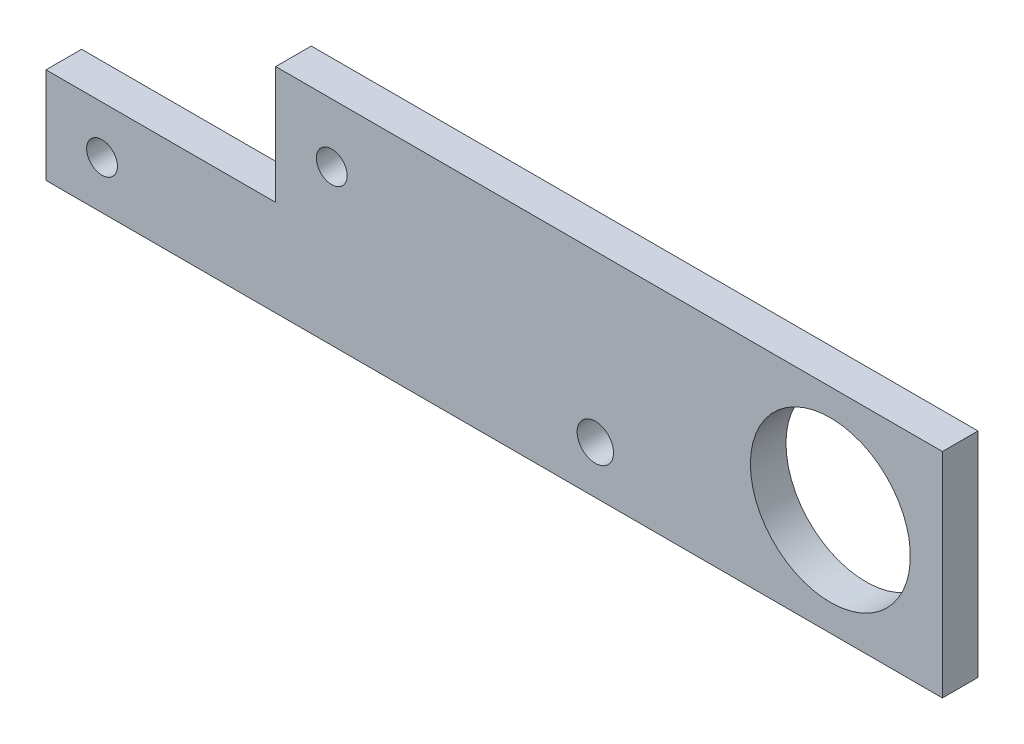
ISO-10303-21;
HEADER;
FILE_DESCRIPTION(('STEP AP214'),'2;1');
FILE_NAME('part.step','',(''),(''),'','','');
FILE_SCHEMA(('AUTOMOTIVE_DESIGN { 1 0 10303 214 1 1 1 1 }'));
ENDSEC;
DATA;
#1=APPLICATION_CONTEXT('core data for automotive mechanical design processes');
#2=APPLICATION_PROTOCOL_DEFINITION('international standard','automotive_design',2000,#1);
#3=PRODUCT_CONTEXT('',#1,'mechanical');
#4=PRODUCT('Part','Part','',(#3));
#5=PRODUCT_RELATED_PRODUCT_CATEGORY('part','',(#4));
#6=PRODUCT_DEFINITION_FORMATION('','',#4);
#7=PRODUCT_DEFINITION_CONTEXT('part definition',#1,'design');
#8=PRODUCT_DEFINITION('design','',#6,#7);
#9=PRODUCT_DEFINITION_SHAPE('','',#8);
#10=(LENGTH_UNIT() NAMED_UNIT(*) SI_UNIT(.MILLI.,.METRE.));
#11=(NAMED_UNIT(*) PLANE_ANGLE_UNIT() SI_UNIT($,.RADIAN.));
#12=(NAMED_UNIT(*) SI_UNIT($,.STERADIAN.) SOLID_ANGLE_UNIT());
#13=UNCERTAINTY_MEASURE_WITH_UNIT(LENGTH_MEASURE(1.E-05),#10,'distance_accuracy_value','');
#14=(GEOMETRIC_REPRESENTATION_CONTEXT(3) GLOBAL_UNCERTAINTY_ASSIGNED_CONTEXT((#13)) GLOBAL_UNIT_ASSIGNED_CONTEXT((#10,
#11,#12)) REPRESENTATION_CONTEXT('',''));
#15=CARTESIAN_POINT('',(0.,0.,0.));
#16=DIRECTION('',(0.,0.,1.));
#17=DIRECTION('',(1.,0.,0.));
#18=AXIS2_PLACEMENT_3D('',#15,#16,#17);
#19=CARTESIAN_POINT('',(0.,0.,6.35));
#20=DIRECTION('',(1.,0.,0.));
#21=DIRECTION('',(0.,1.,0.));
#22=AXIS2_PLACEMENT_3D('',#19,#20,#21);
#23=PLANE('',#22);
#24=DIRECTION('',(0.,0.,1.));
#25=VECTOR('',#24,1.);
#26=CARTESIAN_POINT('',(0.,-21.,0.));
#27=LINE('',#26,#25);
#28=CARTESIAN_POINT('',(0.,-21.,0.));
#29=VERTEX_POINT('',#28);
#30=CARTESIAN_POINT('',(0.,-21.,6.35));
#31=VERTEX_POINT('',#30);
#32=EDGE_CURVE('E104',#29,#31,#27,.T.);
#33=ORIENTED_EDGE('',*,*,#32,.F.);
#34=DIRECTION('',(0.,-1.,0.));
#35=VECTOR('',#34,1.);
#36=CARTESIAN_POINT('',(0.,0.,0.));
#37=LINE('',#36,#35);
#38=CARTESIAN_POINT('',(0.,-38.1,0.));
#39=VERTEX_POINT('',#38);
#40=EDGE_CURVE('E115',#29,#39,#37,.T.);
#41=ORIENTED_EDGE('',*,*,#40,.T.);
#42=DIRECTION('',(0.,0.,-1.));
#43=VECTOR('',#42,1.);
#44=CARTESIAN_POINT('',(0.,-38.1,6.35));
#45=LINE('',#44,#43);
#46=CARTESIAN_POINT('',(0.,-38.1,6.35));
#47=VERTEX_POINT('',#46);
#48=EDGE_CURVE('E11',#47,#39,#45,.T.);
#49=ORIENTED_EDGE('',*,*,#48,.F.);
#50=DIRECTION('',(0.,-1.,0.));
#51=VECTOR('',#50,1.);
#52=CARTESIAN_POINT('',(0.,0.,6.35));
#53=LINE('',#52,#51);
#54=EDGE_CURVE('E81',#31,#47,#53,.T.);
#55=ORIENTED_EDGE('',*,*,#54,.F.);
#56=EDGE_LOOP('',(#33,#41,#49,#55));
#57=FACE_BOUND('',#56,.T.);
#58=ADVANCED_FACE('F39',(#57),#23,.F.);
#59=CARTESIAN_POINT('',(0.,-38.1,6.35));
#60=DIRECTION('',(0.,1.,0.));
#61=DIRECTION('',(0.,0.,1.));
#62=AXIS2_PLACEMENT_3D('',#59,#60,#61);
#63=PLANE('',#62);
#64=DIRECTION('',(1.,0.,0.));
#65=VECTOR('',#64,1.);
#66=CARTESIAN_POINT('',(0.,-38.1,0.));
#67=LINE('',#66,#65);
#68=CARTESIAN_POINT('',(160.,-38.1,0.));
#69=VERTEX_POINT('',#68);
#70=EDGE_CURVE('E116',#39,#69,#67,.T.);
#71=ORIENTED_EDGE('',*,*,#70,.T.);
#72=DIRECTION('',(0.,0.,-1.));
#73=VECTOR('',#72,1.);
#74=CARTESIAN_POINT('',(160.,-38.1,6.35));
#75=LINE('',#74,#73);
#76=CARTESIAN_POINT('',(160.,-38.1,6.35));
#77=VERTEX_POINT('',#76);
#78=EDGE_CURVE('E46',#77,#69,#75,.T.);
#79=ORIENTED_EDGE('',*,*,#78,.F.);
#80=DIRECTION('',(1.,0.,0.));
#81=VECTOR('',#80,1.);
#82=CARTESIAN_POINT('',(0.,-38.1,6.35));
#83=LINE('',#82,#81);
#84=EDGE_CURVE('E145',#47,#77,#83,.T.);
#85=ORIENTED_EDGE('',*,*,#84,.F.);
#86=ORIENTED_EDGE('',*,*,#48,.T.);
#87=EDGE_LOOP('',(#71,#79,#85,#86));
#88=FACE_BOUND('',#87,.T.);
#89=ADVANCED_FACE('F207',(#88),#63,.F.);
#90=CARTESIAN_POINT('',(160.,0.,6.35));
#91=DIRECTION('',(-1.,0.,0.));
#92=DIRECTION('',(0.,0.,1.));
#93=AXIS2_PLACEMENT_3D('',#90,#91,#92);
#94=PLANE('',#93);
#95=DIRECTION('',(0.,1.,0.));
#96=VECTOR('',#95,1.);
#97=CARTESIAN_POINT('',(160.,0.,0.));
#98=LINE('',#97,#96);
#99=CARTESIAN_POINT('',(160.,0.,0.));
#100=VERTEX_POINT('',#99);
#101=EDGE_CURVE('E79',#69,#100,#98,.T.);
#102=ORIENTED_EDGE('',*,*,#101,.T.);
#103=DIRECTION('',(0.,0.,-1.));
#104=VECTOR('',#103,1.);
#105=CARTESIAN_POINT('',(160.,0.,6.35));
#106=LINE('',#105,#104);
#107=CARTESIAN_POINT('',(160.,0.,6.35));
#108=VERTEX_POINT('',#107);
#109=EDGE_CURVE('E132',#108,#100,#106,.T.);
#110=ORIENTED_EDGE('',*,*,#109,.F.);
#111=DIRECTION('',(0.,1.,0.));
#112=VECTOR('',#111,1.);
#113=CARTESIAN_POINT('',(160.,0.,6.35));
#114=LINE('',#113,#112);
#115=EDGE_CURVE('E65',#77,#108,#114,.T.);
#116=ORIENTED_EDGE('',*,*,#115,.F.);
#117=ORIENTED_EDGE('',*,*,#78,.T.);
#118=EDGE_LOOP('',(#102,#110,#116,#117));
#119=FACE_BOUND('',#118,.T.);
#120=ADVANCED_FACE('F134',(#119),#94,.F.);
#121=CARTESIAN_POINT('',(0.,0.,6.35));
#122=DIRECTION('',(0.,-1.,0.));
#123=DIRECTION('',(0.,0.,-1.));
#124=AXIS2_PLACEMENT_3D('',#121,#122,#123);
#125=PLANE('',#124);
#126=DIRECTION('',(-1.,0.,0.));
#127=VECTOR('',#126,1.);
#128=CARTESIAN_POINT('',(0.,0.,0.));
#129=LINE('',#128,#127);
#130=CARTESIAN_POINT('',(41.,0.,0.));
#131=VERTEX_POINT('',#130);
#132=EDGE_CURVE('E129',#100,#131,#129,.T.);
#133=ORIENTED_EDGE('',*,*,#132,.T.);
#134=DIRECTION('',(0.,0.,1.));
#135=VECTOR('',#134,1.);
#136=CARTESIAN_POINT('',(41.,0.,0.));
#137=LINE('',#136,#135);
#138=CARTESIAN_POINT('',(41.,0.,6.35));
#139=VERTEX_POINT('',#138);
#140=EDGE_CURVE('E137',#131,#139,#137,.T.);
#141=ORIENTED_EDGE('',*,*,#140,.T.);
#142=DIRECTION('',(-1.,0.,0.));
#143=VECTOR('',#142,1.);
#144=CARTESIAN_POINT('',(0.,0.,6.35));
#145=LINE('',#144,#143);
#146=EDGE_CURVE('E121',#108,#139,#145,.T.);
#147=ORIENTED_EDGE('',*,*,#146,.F.);
#148=ORIENTED_EDGE('',*,*,#109,.T.);
#149=EDGE_LOOP('',(#133,#141,#147,#148));
#150=FACE_BOUND('',#149,.T.);
#151=ADVANCED_FACE('F136',(#150),#125,.F.);
#152=CARTESIAN_POINT('',(0.,0.,6.35));
#153=DIRECTION('',(0.,0.,1.));
#154=DIRECTION('',(1.,0.,0.));
#155=AXIS2_PLACEMENT_3D('',#152,#153,#154);
#156=PLANE('',#155);
#157=CARTESIAN_POINT('',(10.,-29.55,6.35));
#158=DIRECTION('',(0.,0.,1.));
#159=DIRECTION('',(1.,0.,0.));
#160=AXIS2_PLACEMENT_3D('',#157,#158,#159);
#161=CIRCLE('',#160,2.75);
#162=CARTESIAN_POINT('',(12.75,-29.55,6.35));
#163=VERTEX_POINT('',#162);
#164=EDGE_CURVE('E170',#163,#163,#161,.T.);
#165=ORIENTED_EDGE('',*,*,#164,.F.);
#166=EDGE_LOOP('',(#165));
#167=FACE_BOUND('',#166,.T.);
#168=CARTESIAN_POINT('',(51.,-10.5,6.35));
#169=DIRECTION('',(0.,0.,1.));
#170=DIRECTION('',(1.,0.,0.));
#171=AXIS2_PLACEMENT_3D('',#168,#169,#170);
#172=CIRCLE('',#171,2.75);
#173=CARTESIAN_POINT('',(53.75,-10.5,6.35));
#174=VERTEX_POINT('',#173);
#175=EDGE_CURVE('E165',#174,#174,#172,.T.);
#176=ORIENTED_EDGE('',*,*,#175,.F.);
#177=EDGE_LOOP('',(#176));
#178=FACE_BOUND('',#177,.T.);
#179=CARTESIAN_POINT('',(98.0496012690253,-29.55,6.35));
#180=DIRECTION('',(0.,0.,1.));
#181=DIRECTION('',(1.,0.,0.));
#182=AXIS2_PLACEMENT_3D('',#179,#180,#181);
#183=CIRCLE('',#182,3.25000000000001);
#184=CARTESIAN_POINT('',(101.299601269025,-29.55,6.35));
#185=VERTEX_POINT('',#184);
#186=EDGE_CURVE('E156',#185,#185,#183,.T.);
#187=ORIENTED_EDGE('',*,*,#186,.F.);
#188=EDGE_LOOP('',(#187));
#189=FACE_BOUND('',#188,.T.);
#190=DIRECTION('',(1.,0.,0.));
#191=VECTOR('',#190,1.);
#192=CARTESIAN_POINT('',(0.,-21.,6.35));
#193=LINE('',#192,#191);
#194=CARTESIAN_POINT('',(41.,-21.,6.35));
#195=VERTEX_POINT('',#194);
#196=EDGE_CURVE('E152',#31,#195,#193,.T.);
#197=ORIENTED_EDGE('',*,*,#196,.F.);
#198=ORIENTED_EDGE('',*,*,#54,.T.);
#199=ORIENTED_EDGE('',*,*,#84,.T.);
#200=ORIENTED_EDGE('',*,*,#115,.T.);
#201=ORIENTED_EDGE('',*,*,#146,.T.);
#202=DIRECTION('',(0.,1.,0.));
#203=VECTOR('',#202,1.);
#204=CARTESIAN_POINT('',(41.,0.,6.35));
#205=LINE('',#204,#203);
#206=EDGE_CURVE('E108',#195,#139,#205,.T.);
#207=ORIENTED_EDGE('',*,*,#206,.F.);
#208=EDGE_LOOP('',(#197,#198,#199,#200,#201,#207));
#209=FACE_BOUND('',#208,.T.);
#210=CARTESIAN_POINT('',(140.,-19.05,6.35));
#211=DIRECTION('',(0.,0.,-1.));
#212=DIRECTION('',(-1.,0.,0.));
#213=AXIS2_PLACEMENT_3D('',#210,#211,#212);
#214=CIRCLE('',#213,14.275);
#215=CARTESIAN_POINT('',(125.725,-19.05,6.35));
#216=VERTEX_POINT('',#215);
#217=EDGE_CURVE('E120',#216,#216,#214,.T.);
#218=ORIENTED_EDGE('',*,*,#217,.T.);
#219=EDGE_LOOP('',(#218));
#220=FACE_BOUND('',#219,.T.);
#221=ADVANCED_FACE('F185',(#167,#178,#189,#209,#220),#156,.T.);
#222=CARTESIAN_POINT('',(0.,0.,0.));
#223=DIRECTION('',(0.,0.,1.));
#224=DIRECTION('',(1.,0.,0.));
#225=AXIS2_PLACEMENT_3D('',#222,#223,#224);
#226=PLANE('',#225);
#227=CARTESIAN_POINT('',(10.,-29.55,0.));
#228=DIRECTION('',(0.,0.,1.));
#229=DIRECTION('',(1.,0.,0.));
#230=AXIS2_PLACEMENT_3D('',#227,#228,#229);
#231=CIRCLE('',#230,2.75);
#232=CARTESIAN_POINT('',(12.75,-29.55,0.));
#233=VERTEX_POINT('',#232);
#234=EDGE_CURVE('E154',#233,#233,#231,.T.);
#235=ORIENTED_EDGE('',*,*,#234,.T.);
#236=EDGE_LOOP('',(#235));
#237=FACE_BOUND('',#236,.T.);
#238=CARTESIAN_POINT('',(51.,-10.5,0.));
#239=DIRECTION('',(0.,0.,1.));
#240=DIRECTION('',(1.,0.,0.));
#241=AXIS2_PLACEMENT_3D('',#238,#239,#240);
#242=CIRCLE('',#241,2.75);
#243=CARTESIAN_POINT('',(53.75,-10.5,0.));
#244=VERTEX_POINT('',#243);
#245=EDGE_CURVE('E163',#244,#244,#242,.T.);
#246=ORIENTED_EDGE('',*,*,#245,.T.);
#247=EDGE_LOOP('',(#246));
#248=FACE_BOUND('',#247,.T.);
#249=CARTESIAN_POINT('',(98.0496012690253,-29.55,0.));
#250=DIRECTION('',(0.,0.,1.));
#251=DIRECTION('',(1.,0.,0.));
#252=AXIS2_PLACEMENT_3D('',#249,#250,#251);
#253=CIRCLE('',#252,3.25000000000001);
#254=CARTESIAN_POINT('',(101.299601269025,-29.55,0.));
#255=VERTEX_POINT('',#254);
#256=EDGE_CURVE('E153',#255,#255,#253,.T.);
#257=ORIENTED_EDGE('',*,*,#256,.T.);
#258=EDGE_LOOP('',(#257));
#259=FACE_BOUND('',#258,.T.);
#260=CARTESIAN_POINT('',(140.,-19.05,0.));
#261=DIRECTION('',(0.,0.,-1.));
#262=DIRECTION('',(-1.,0.,0.));
#263=AXIS2_PLACEMENT_3D('',#260,#261,#262);
#264=CIRCLE('',#263,14.275);
#265=CARTESIAN_POINT('',(125.725,-19.05,0.));
#266=VERTEX_POINT('',#265);
#267=EDGE_CURVE('E122',#266,#266,#264,.T.);
#268=ORIENTED_EDGE('',*,*,#267,.F.);
#269=EDGE_LOOP('',(#268));
#270=FACE_BOUND('',#269,.T.);
#271=DIRECTION('',(1.,0.,0.));
#272=VECTOR('',#271,1.);
#273=CARTESIAN_POINT('',(0.,-21.,0.));
#274=LINE('',#273,#272);
#275=CARTESIAN_POINT('',(41.,-21.,0.));
#276=VERTEX_POINT('',#275);
#277=EDGE_CURVE('E99',#29,#276,#274,.T.);
#278=ORIENTED_EDGE('',*,*,#277,.T.);
#279=DIRECTION('',(0.,1.,0.));
#280=VECTOR('',#279,1.);
#281=CARTESIAN_POINT('',(41.,0.,0.));
#282=LINE('',#281,#280);
#283=EDGE_CURVE('E52',#276,#131,#282,.T.);
#284=ORIENTED_EDGE('',*,*,#283,.T.);
#285=ORIENTED_EDGE('',*,*,#132,.F.);
#286=ORIENTED_EDGE('',*,*,#101,.F.);
#287=ORIENTED_EDGE('',*,*,#70,.F.);
#288=ORIENTED_EDGE('',*,*,#40,.F.);
#289=EDGE_LOOP('',(#278,#284,#285,#286,#287,#288));
#290=FACE_BOUND('',#289,.T.);
#291=ADVANCED_FACE('F114',(#237,#248,#259,#270,#290),#226,.F.);
#292=CARTESIAN_POINT('',(140.,-19.05,6.35));
#293=DIRECTION('',(0.,0.,-1.));
#294=DIRECTION('',(-1.,0.,0.));
#295=AXIS2_PLACEMENT_3D('',#292,#293,#294);
#296=CYLINDRICAL_SURFACE('',#295,14.275);
#297=ORIENTED_EDGE('',*,*,#217,.F.);
#298=EDGE_LOOP('',(#297));
#299=FACE_BOUND('',#298,.T.);
#300=ORIENTED_EDGE('',*,*,#267,.T.);
#301=EDGE_LOOP('',(#300));
#302=FACE_BOUND('',#301,.T.);
#303=ADVANCED_FACE('F195',(#299,#302),#296,.F.);
#304=CARTESIAN_POINT('',(41.,0.,0.));
#305=DIRECTION('',(1.,0.,0.));
#306=DIRECTION('',(0.,0.,-1.));
#307=AXIS2_PLACEMENT_3D('',#304,#305,#306);
#308=PLANE('',#307);
#309=ORIENTED_EDGE('',*,*,#206,.T.);
#310=ORIENTED_EDGE('',*,*,#140,.F.);
#311=ORIENTED_EDGE('',*,*,#283,.F.);
#312=DIRECTION('',(0.,0.,1.));
#313=VECTOR('',#312,1.);
#314=CARTESIAN_POINT('',(41.,-21.,0.));
#315=LINE('',#314,#313);
#316=EDGE_CURVE('E102',#276,#195,#315,.T.);
#317=ORIENTED_EDGE('',*,*,#316,.T.);
#318=EDGE_LOOP('',(#309,#310,#311,#317));
#319=FACE_BOUND('',#318,.T.);
#320=ADVANCED_FACE('F193',(#319),#308,.F.);
#321=CARTESIAN_POINT('',(0.,-21.,0.));
#322=DIRECTION('',(0.,-1.,0.));
#323=DIRECTION('',(0.,0.,-1.));
#324=AXIS2_PLACEMENT_3D('',#321,#322,#323);
#325=PLANE('',#324);
#326=ORIENTED_EDGE('',*,*,#196,.T.);
#327=ORIENTED_EDGE('',*,*,#316,.F.);
#328=ORIENTED_EDGE('',*,*,#277,.F.);
#329=ORIENTED_EDGE('',*,*,#32,.T.);
#330=EDGE_LOOP('',(#326,#327,#328,#329));
#331=FACE_BOUND('',#330,.T.);
#332=ADVANCED_FACE('F101',(#331),#325,.F.);
#333=CARTESIAN_POINT('',(98.0496012690253,-29.55,0.));
#334=DIRECTION('',(0.,0.,1.));
#335=DIRECTION('',(1.,0.,0.));
#336=AXIS2_PLACEMENT_3D('',#333,#334,#335);
#337=CYLINDRICAL_SURFACE('',#336,3.25000000000001);
#338=ORIENTED_EDGE('',*,*,#256,.F.);
#339=EDGE_LOOP('',(#338));
#340=FACE_BOUND('',#339,.T.);
#341=ORIENTED_EDGE('',*,*,#186,.T.);
#342=EDGE_LOOP('',(#341));
#343=FACE_BOUND('',#342,.T.);
#344=ADVANCED_FACE('F231',(#340,#343),#337,.F.);
#345=CARTESIAN_POINT('',(51.,-10.5,0.));
#346=DIRECTION('',(0.,0.,1.));
#347=DIRECTION('',(1.,0.,0.));
#348=AXIS2_PLACEMENT_3D('',#345,#346,#347);
#349=CYLINDRICAL_SURFACE('',#348,2.75);
#350=ORIENTED_EDGE('',*,*,#245,.F.);
#351=EDGE_LOOP('',(#350));
#352=FACE_BOUND('',#351,.T.);
#353=ORIENTED_EDGE('',*,*,#175,.T.);
#354=EDGE_LOOP('',(#353));
#355=FACE_BOUND('',#354,.T.);
#356=ADVANCED_FACE('F178',(#352,#355),#349,.F.);
#357=CARTESIAN_POINT('',(10.,-29.55,0.));
#358=DIRECTION('',(0.,0.,1.));
#359=DIRECTION('',(1.,0.,0.));
#360=AXIS2_PLACEMENT_3D('',#357,#358,#359);
#361=CYLINDRICAL_SURFACE('',#360,2.75);
#362=ORIENTED_EDGE('',*,*,#234,.F.);
#363=EDGE_LOOP('',(#362));
#364=FACE_BOUND('',#363,.T.);
#365=ORIENTED_EDGE('',*,*,#164,.T.);
#366=EDGE_LOOP('',(#365));
#367=FACE_BOUND('',#366,.T.);
#368=ADVANCED_FACE('F174',(#364,#367),#361,.F.);
#369=CLOSED_SHELL('',(#58,#89,#120,#151,#221,#291,#303,#320,#332,#344,#356,#368));
#370=MANIFOLD_SOLID_BREP('B2',#369);
#371=ADVANCED_BREP_SHAPE_REPRESENTATION('',(#18,#370),#14);
#372=SHAPE_DEFINITION_REPRESENTATION(#9,#371);
ENDSEC;
END-ISO-10303-21;
